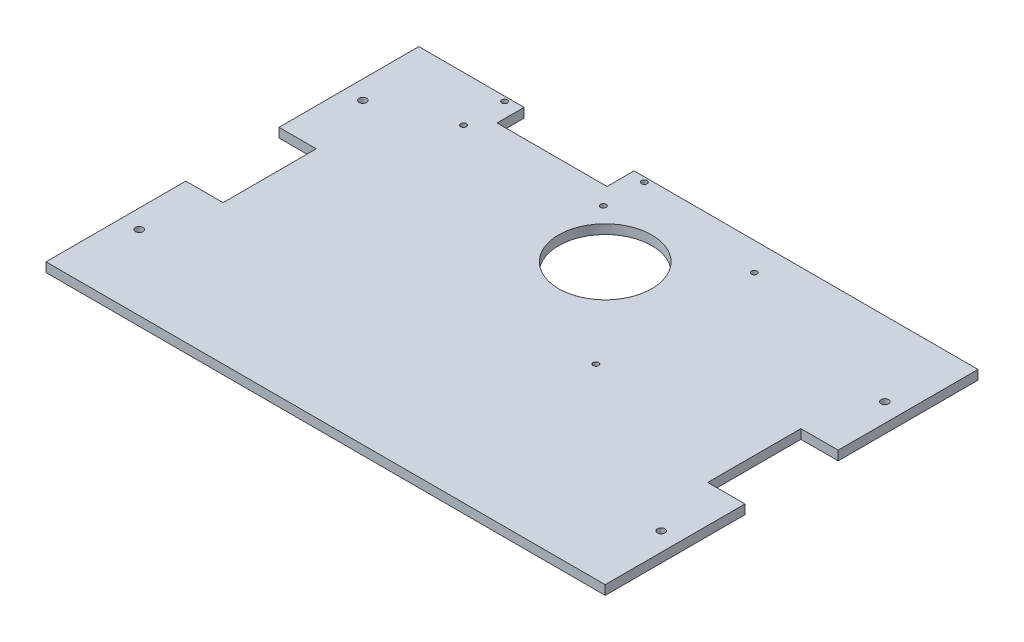
ISO-10303-21;
HEADER;
FILE_DESCRIPTION(('STEP AP214'),'2;1');
FILE_NAME('part.step','',(''),(''),'','','');
FILE_SCHEMA(('AUTOMOTIVE_DESIGN { 1 0 10303 214 1 1 1 1 }'));
ENDSEC;
DATA;
#1=APPLICATION_CONTEXT('core data for automotive mechanical design processes');
#2=APPLICATION_PROTOCOL_DEFINITION('international standard','automotive_design',2000,#1);
#3=PRODUCT_CONTEXT('',#1,'mechanical');
#4=PRODUCT('Part','Part','',(#3));
#5=PRODUCT_RELATED_PRODUCT_CATEGORY('part','',(#4));
#6=PRODUCT_DEFINITION_FORMATION('','',#4);
#7=PRODUCT_DEFINITION_CONTEXT('part definition',#1,'design');
#8=PRODUCT_DEFINITION('design','',#6,#7);
#9=PRODUCT_DEFINITION_SHAPE('','',#8);
#10=(LENGTH_UNIT() NAMED_UNIT(*) SI_UNIT(.MILLI.,.METRE.));
#11=(NAMED_UNIT(*) PLANE_ANGLE_UNIT() SI_UNIT($,.RADIAN.));
#12=(NAMED_UNIT(*) SI_UNIT($,.STERADIAN.) SOLID_ANGLE_UNIT());
#13=UNCERTAINTY_MEASURE_WITH_UNIT(LENGTH_MEASURE(1.E-05),#10,'distance_accuracy_value','');
#14=(GEOMETRIC_REPRESENTATION_CONTEXT(3) GLOBAL_UNCERTAINTY_ASSIGNED_CONTEXT((#13)) GLOBAL_UNIT_ASSIGNED_CONTEXT((#10,
#11,#12)) REPRESENTATION_CONTEXT('',''));
#15=CARTESIAN_POINT('',(0.,0.,0.));
#16=DIRECTION('',(0.,0.,1.));
#17=DIRECTION('',(1.,0.,0.));
#18=AXIS2_PLACEMENT_3D('',#15,#16,#17);
#19=CARTESIAN_POINT('',(150.,5.,-100.));
#20=DIRECTION('',(-1.,0.,0.));
#21=DIRECTION('',(0.,0.,1.));
#22=AXIS2_PLACEMENT_3D('',#19,#20,#21);
#23=PLANE('',#22);
#24=DIRECTION('',(0.,0.,-1.));
#25=VECTOR('',#24,1.);
#26=CARTESIAN_POINT('',(150.,5.,-100.));
#27=LINE('',#26,#25);
#28=CARTESIAN_POINT('',(150.,5.,-25.));
#29=VERTEX_POINT('',#28);
#30=CARTESIAN_POINT('',(150.,5.,-100.));
#31=VERTEX_POINT('',#30);
#32=EDGE_CURVE('E186',#29,#31,#27,.T.);
#33=ORIENTED_EDGE('',*,*,#32,.F.);
#34=DIRECTION('',(0.,1.,0.));
#35=VECTOR('',#34,1.);
#36=CARTESIAN_POINT('',(150.,0.,-25.));
#37=LINE('',#36,#35);
#38=CARTESIAN_POINT('',(150.,0.,-25.));
#39=VERTEX_POINT('',#38);
#40=EDGE_CURVE('E363',#39,#29,#37,.T.);
#41=ORIENTED_EDGE('',*,*,#40,.F.);
#42=DIRECTION('',(0.,0.,-1.));
#43=VECTOR('',#42,1.);
#44=CARTESIAN_POINT('',(150.,0.,-100.));
#45=LINE('',#44,#43);
#46=CARTESIAN_POINT('',(150.,0.,-100.));
#47=VERTEX_POINT('',#46);
#48=EDGE_CURVE('E319',#39,#47,#45,.T.);
#49=ORIENTED_EDGE('',*,*,#48,.T.);
#50=DIRECTION('',(0.,-1.,0.));
#51=VECTOR('',#50,1.);
#52=CARTESIAN_POINT('',(150.,5.,-100.));
#53=LINE('',#52,#51);
#54=EDGE_CURVE('E12',#31,#47,#53,.T.);
#55=ORIENTED_EDGE('',*,*,#54,.F.);
#56=EDGE_LOOP('',(#33,#41,#49,#55));
#57=FACE_BOUND('',#56,.T.);
#58=ADVANCED_FACE('F39',(#57),#23,.F.);
#59=CARTESIAN_POINT('',(-150.,5.,-100.));
#60=DIRECTION('',(1.,0.,0.));
#61=DIRECTION('',(0.,0.,-1.));
#62=AXIS2_PLACEMENT_3D('',#59,#60,#61);
#63=PLANE('',#62);
#64=DIRECTION('',(0.,0.,1.));
#65=VECTOR('',#64,1.);
#66=CARTESIAN_POINT('',(-150.,0.,-100.));
#67=LINE('',#66,#65);
#68=CARTESIAN_POINT('',(-150.,0.,-100.));
#69=VERTEX_POINT('',#68);
#70=CARTESIAN_POINT('',(-150.,0.,-25.));
#71=VERTEX_POINT('',#70);
#72=EDGE_CURVE('E176',#69,#71,#67,.T.);
#73=ORIENTED_EDGE('',*,*,#72,.T.);
#74=DIRECTION('',(0.,1.,0.));
#75=VECTOR('',#74,1.);
#76=CARTESIAN_POINT('',(-150.,0.,-25.));
#77=LINE('',#76,#75);
#78=CARTESIAN_POINT('',(-150.,5.,-25.));
#79=VERTEX_POINT('',#78);
#80=EDGE_CURVE('E254',#71,#79,#77,.T.);
#81=ORIENTED_EDGE('',*,*,#80,.T.);
#82=DIRECTION('',(0.,0.,1.));
#83=VECTOR('',#82,1.);
#84=CARTESIAN_POINT('',(-150.,5.,-100.));
#85=LINE('',#84,#83);
#86=CARTESIAN_POINT('',(-150.,5.,-100.));
#87=VERTEX_POINT('',#86);
#88=EDGE_CURVE('E200',#87,#79,#85,.T.);
#89=ORIENTED_EDGE('',*,*,#88,.F.);
#90=DIRECTION('',(0.,-1.,0.));
#91=VECTOR('',#90,1.);
#92=CARTESIAN_POINT('',(-150.,5.,-100.));
#93=LINE('',#92,#91);
#94=EDGE_CURVE('E47',#87,#69,#93,.T.);
#95=ORIENTED_EDGE('',*,*,#94,.T.);
#96=EDGE_LOOP('',(#73,#81,#89,#95));
#97=FACE_BOUND('',#96,.T.);
#98=ADVANCED_FACE('F197',(#97),#63,.F.);
#99=CARTESIAN_POINT('',(-150.,5.,-100.));
#100=DIRECTION('',(0.,0.,1.));
#101=DIRECTION('',(1.,0.,0.));
#102=AXIS2_PLACEMENT_3D('',#99,#100,#101);
#103=PLANE('',#102);
#104=DIRECTION('',(-1.,0.,0.));
#105=VECTOR('',#104,1.);
#106=CARTESIAN_POINT('',(-150.,5.,-100.));
#107=LINE('',#106,#105);
#108=CARTESIAN_POINT('',(-93.5,5.,-100.));
#109=VERTEX_POINT('',#108);
#110=EDGE_CURVE('E346',#109,#87,#107,.T.);
#111=ORIENTED_EDGE('',*,*,#110,.F.);
#112=DIRECTION('',(0.,-1.,0.));
#113=VECTOR('',#112,1.);
#114=CARTESIAN_POINT('',(-93.5,5.,-100.));
#115=LINE('',#114,#113);
#116=CARTESIAN_POINT('',(-93.5,0.,-100.));
#117=VERTEX_POINT('',#116);
#118=EDGE_CURVE('E270',#109,#117,#115,.T.);
#119=ORIENTED_EDGE('',*,*,#118,.T.);
#120=DIRECTION('',(-1.,0.,0.));
#121=VECTOR('',#120,1.);
#122=CARTESIAN_POINT('',(-150.,0.,-100.));
#123=LINE('',#122,#121);
#124=EDGE_CURVE('E181',#117,#69,#123,.T.);
#125=ORIENTED_EDGE('',*,*,#124,.T.);
#126=ORIENTED_EDGE('',*,*,#94,.F.);
#127=EDGE_LOOP('',(#111,#119,#125,#126));
#128=FACE_BOUND('',#127,.T.);
#129=ADVANCED_FACE('F407',(#128),#103,.F.);
#130=CARTESIAN_POINT('',(150.,0.,100.));
#131=VERTEX_POINT('',#130);
#132=CARTESIAN_POINT('',(150.,0.,25.));
#133=VERTEX_POINT('',#132);
#134=EDGE_CURVE('E385',#131,#133,#45,.T.);
#135=ORIENTED_EDGE('',*,*,#134,.T.);
#136=DIRECTION('',(0.,1.,0.));
#137=VECTOR('',#136,1.);
#138=CARTESIAN_POINT('',(150.,0.,25.));
#139=LINE('',#138,#137);
#140=CARTESIAN_POINT('',(150.,5.,25.));
#141=VERTEX_POINT('',#140);
#142=EDGE_CURVE('E62',#133,#141,#139,.T.);
#143=ORIENTED_EDGE('',*,*,#142,.T.);
#144=CARTESIAN_POINT('',(150.,5.,100.));
#145=VERTEX_POINT('',#144);
#146=EDGE_CURVE('E343',#145,#141,#27,.T.);
#147=ORIENTED_EDGE('',*,*,#146,.F.);
#148=DIRECTION('',(0.,-1.,0.));
#149=VECTOR('',#148,1.);
#150=CARTESIAN_POINT('',(150.,5.,100.));
#151=LINE('',#150,#149);
#152=EDGE_CURVE('E187',#145,#131,#151,.T.);
#153=ORIENTED_EDGE('',*,*,#152,.T.);
#154=EDGE_LOOP('',(#135,#143,#147,#153));
#155=FACE_BOUND('',#154,.T.);
#156=ADVANCED_FACE('F41',(#155),#23,.F.);
#157=CARTESIAN_POINT('',(-34.5,0.,-100.));
#158=VERTEX_POINT('',#157);
#159=EDGE_CURVE('E177',#47,#158,#123,.T.);
#160=ORIENTED_EDGE('',*,*,#159,.T.);
#161=DIRECTION('',(0.,-1.,0.));
#162=VECTOR('',#161,1.);
#163=CARTESIAN_POINT('',(-34.5,5.,-100.));
#164=LINE('',#163,#162);
#165=CARTESIAN_POINT('',(-34.5,5.,-100.));
#166=VERTEX_POINT('',#165);
#167=EDGE_CURVE('E283',#166,#158,#164,.T.);
#168=ORIENTED_EDGE('',*,*,#167,.F.);
#169=EDGE_CURVE('E228',#31,#166,#107,.T.);
#170=ORIENTED_EDGE('',*,*,#169,.F.);
#171=ORIENTED_EDGE('',*,*,#54,.T.);
#172=EDGE_LOOP('',(#160,#168,#170,#171));
#173=FACE_BOUND('',#172,.T.);
#174=ADVANCED_FACE('F403',(#173),#103,.F.);
#175=CARTESIAN_POINT('',(-150.,5.,25.));
#176=VERTEX_POINT('',#175);
#177=CARTESIAN_POINT('',(-150.,5.,100.));
#178=VERTEX_POINT('',#177);
#179=EDGE_CURVE('E169',#176,#178,#85,.T.);
#180=ORIENTED_EDGE('',*,*,#179,.F.);
#181=DIRECTION('',(0.,1.,0.));
#182=VECTOR('',#181,1.);
#183=CARTESIAN_POINT('',(-150.,0.,25.));
#184=LINE('',#183,#182);
#185=CARTESIAN_POINT('',(-150.,0.,25.));
#186=VERTEX_POINT('',#185);
#187=EDGE_CURVE('E156',#186,#176,#184,.T.);
#188=ORIENTED_EDGE('',*,*,#187,.F.);
#189=CARTESIAN_POINT('',(-150.,0.,100.));
#190=VERTEX_POINT('',#189);
#191=EDGE_CURVE('E167',#186,#190,#67,.T.);
#192=ORIENTED_EDGE('',*,*,#191,.T.);
#193=DIRECTION('',(0.,-1.,0.));
#194=VECTOR('',#193,1.);
#195=CARTESIAN_POINT('',(-150.,5.,100.));
#196=LINE('',#195,#194);
#197=EDGE_CURVE('E190',#178,#190,#196,.T.);
#198=ORIENTED_EDGE('',*,*,#197,.F.);
#199=EDGE_LOOP('',(#180,#188,#192,#198));
#200=FACE_BOUND('',#199,.T.);
#201=ADVANCED_FACE('F165',(#200),#63,.F.);
#202=CARTESIAN_POINT('',(-150.,5.,100.));
#203=DIRECTION('',(0.,0.,-1.));
#204=DIRECTION('',(-1.,0.,0.));
#205=AXIS2_PLACEMENT_3D('',#202,#203,#204);
#206=PLANE('',#205);
#207=DIRECTION('',(1.,0.,0.));
#208=VECTOR('',#207,1.);
#209=CARTESIAN_POINT('',(-150.,0.,100.));
#210=LINE('',#209,#208);
#211=EDGE_CURVE('E175',#190,#131,#210,.T.);
#212=ORIENTED_EDGE('',*,*,#211,.T.);
#213=ORIENTED_EDGE('',*,*,#152,.F.);
#214=DIRECTION('',(1.,0.,0.));
#215=VECTOR('',#214,1.);
#216=CARTESIAN_POINT('',(-150.,5.,100.));
#217=LINE('',#216,#215);
#218=EDGE_CURVE('E191',#178,#145,#217,.T.);
#219=ORIENTED_EDGE('',*,*,#218,.F.);
#220=ORIENTED_EDGE('',*,*,#197,.T.);
#221=EDGE_LOOP('',(#212,#213,#219,#220));
#222=FACE_BOUND('',#221,.T.);
#223=ADVANCED_FACE('F392',(#222),#206,.F.);
#224=CARTESIAN_POINT('',(0.,5.,0.));
#225=DIRECTION('',(0.,1.,0.));
#226=DIRECTION('',(0.,0.,1.));
#227=AXIS2_PLACEMENT_3D('',#224,#225,#226);
#228=PLANE('',#227);
#229=DIRECTION('',(-1.,0.,0.));
#230=VECTOR('',#229,1.);
#231=CARTESIAN_POINT('',(-130.,5.,-25.));
#232=LINE('',#231,#230);
#233=CARTESIAN_POINT('',(-130.,5.,-25.));
#234=VERTEX_POINT('',#233);
#235=EDGE_CURVE('E161',#234,#79,#232,.T.);
#236=ORIENTED_EDGE('',*,*,#235,.F.);
#237=DIRECTION('',(0.,0.,-1.));
#238=VECTOR('',#237,1.);
#239=CARTESIAN_POINT('',(-130.,5.,25.));
#240=LINE('',#239,#238);
#241=CARTESIAN_POINT('',(-130.,5.,25.));
#242=VERTEX_POINT('',#241);
#243=EDGE_CURVE('E214',#242,#234,#240,.T.);
#244=ORIENTED_EDGE('',*,*,#243,.F.);
#245=DIRECTION('',(1.,0.,0.));
#246=VECTOR('',#245,1.);
#247=CARTESIAN_POINT('',(-130.,5.,25.));
#248=LINE('',#247,#246);
#249=EDGE_CURVE('E211',#176,#242,#248,.T.);
#250=ORIENTED_EDGE('',*,*,#249,.F.);
#251=ORIENTED_EDGE('',*,*,#179,.T.);
#252=ORIENTED_EDGE('',*,*,#218,.T.);
#253=ORIENTED_EDGE('',*,*,#146,.T.);
#254=DIRECTION('',(1.,0.,0.));
#255=VECTOR('',#254,1.);
#256=CARTESIAN_POINT('',(130.,5.,25.));
#257=LINE('',#256,#255);
#258=CARTESIAN_POINT('',(130.,5.,25.));
#259=VERTEX_POINT('',#258);
#260=EDGE_CURVE('E360',#259,#141,#257,.T.);
#261=ORIENTED_EDGE('',*,*,#260,.F.);
#262=DIRECTION('',(0.,0.,1.));
#263=VECTOR('',#262,1.);
#264=CARTESIAN_POINT('',(130.,5.,25.));
#265=LINE('',#264,#263);
#266=CARTESIAN_POINT('',(130.,5.,-25.));
#267=VERTEX_POINT('',#266);
#268=EDGE_CURVE('E375',#267,#259,#265,.T.);
#269=ORIENTED_EDGE('',*,*,#268,.F.);
#270=DIRECTION('',(-1.,0.,0.));
#271=VECTOR('',#270,1.);
#272=CARTESIAN_POINT('',(130.,5.,-25.));
#273=LINE('',#272,#271);
#274=EDGE_CURVE('E354',#29,#267,#273,.T.);
#275=ORIENTED_EDGE('',*,*,#274,.F.);
#276=ORIENTED_EDGE('',*,*,#32,.T.);
#277=ORIENTED_EDGE('',*,*,#169,.T.);
#278=DIRECTION('',(0.,0.,1.));
#279=VECTOR('',#278,1.);
#280=CARTESIAN_POINT('',(-34.5,5.,-100.));
#281=LINE('',#280,#279);
#282=CARTESIAN_POINT('',(-34.5,5.,-85.5));
#283=VERTEX_POINT('',#282);
#284=EDGE_CURVE('E259',#166,#283,#281,.T.);
#285=ORIENTED_EDGE('',*,*,#284,.T.);
#286=DIRECTION('',(-1.,0.,0.));
#287=VECTOR('',#286,1.);
#288=CARTESIAN_POINT('',(-93.5,5.,-85.5));
#289=LINE('',#288,#287);
#290=CARTESIAN_POINT('',(-93.5,5.,-85.5));
#291=VERTEX_POINT('',#290);
#292=EDGE_CURVE('E266',#283,#291,#289,.T.);
#293=ORIENTED_EDGE('',*,*,#292,.T.);
#294=DIRECTION('',(0.,0.,-1.));
#295=VECTOR('',#294,1.);
#296=CARTESIAN_POINT('',(-93.5,5.,-100.));
#297=LINE('',#296,#295);
#298=EDGE_CURVE('E255',#291,#109,#297,.T.);
#299=ORIENTED_EDGE('',*,*,#298,.T.);
#300=ORIENTED_EDGE('',*,*,#110,.T.);
#301=ORIENTED_EDGE('',*,*,#88,.T.);
#302=EDGE_LOOP('',(#236,#244,#250,#251,#252,#253,#261,#269,#275,#276,#277,#285,#293,#299,#300,#301));
#303=FACE_BOUND('',#302,.T.);
#304=CARTESIAN_POINT('',(45.0000000000001,5.,-85.));
#305=DIRECTION('',(0.,1.,0.));
#306=DIRECTION('',(0.,0.,1.));
#307=AXIS2_PLACEMENT_3D('',#304,#305,#306);
#308=CIRCLE('',#307,1.5);
#309=CARTESIAN_POINT('',(45.0000000000001,5.,-83.5));
#310=VERTEX_POINT('',#309);
#311=EDGE_CURVE('E241',#310,#310,#308,.T.);
#312=ORIENTED_EDGE('',*,*,#311,.F.);
#313=EDGE_LOOP('',(#312));
#314=FACE_BOUND('',#313,.T.);
#315=CARTESIAN_POINT('',(45.0000000000001,5.,0.));
#316=DIRECTION('',(0.,1.,0.));
#317=DIRECTION('',(0.,0.,1.));
#318=AXIS2_PLACEMENT_3D('',#315,#316,#317);
#319=CIRCLE('',#318,1.5);
#320=CARTESIAN_POINT('',(45.0000000000001,5.,1.50000000000004));
#321=VERTEX_POINT('',#320);
#322=EDGE_CURVE('E250',#321,#321,#319,.T.);
#323=ORIENTED_EDGE('',*,*,#322,.F.);
#324=EDGE_LOOP('',(#323));
#325=FACE_BOUND('',#324,.T.);
#326=CARTESIAN_POINT('',(-101.5,5.,-75.4999999999999));
#327=DIRECTION('',(0.,1.,0.));
#328=DIRECTION('',(0.,0.,1.));
#329=AXIS2_PLACEMENT_3D('',#326,#327,#328);
#330=CIRCLE('',#329,1.5);
#331=CARTESIAN_POINT('',(-101.5,5.,-73.9999999999999));
#332=VERTEX_POINT('',#331);
#333=EDGE_CURVE('E280',#332,#332,#330,.T.);
#334=ORIENTED_EDGE('',*,*,#333,.F.);
#335=EDGE_LOOP('',(#334));
#336=FACE_BOUND('',#335,.T.);
#337=CARTESIAN_POINT('',(-26.5,5.,-75.5));
#338=DIRECTION('',(0.,1.,0.));
#339=DIRECTION('',(0.,0.,1.));
#340=AXIS2_PLACEMENT_3D('',#337,#338,#339);
#341=CIRCLE('',#340,1.5);
#342=CARTESIAN_POINT('',(-26.5,5.,-74.));
#343=VERTEX_POINT('',#342);
#344=EDGE_CURVE('E692',#343,#343,#341,.T.);
#345=ORIENTED_EDGE('',*,*,#344,.F.);
#346=EDGE_LOOP('',(#345));
#347=FACE_BOUND('',#346,.T.);
#348=CARTESIAN_POINT('',(-26.5,5.,-97.5));
#349=DIRECTION('',(0.,1.,0.));
#350=DIRECTION('',(0.,0.,1.));
#351=AXIS2_PLACEMENT_3D('',#348,#349,#350);
#352=CIRCLE('',#351,1.5);
#353=CARTESIAN_POINT('',(-26.5,5.,-96.));
#354=VERTEX_POINT('',#353);
#355=EDGE_CURVE('E291',#354,#354,#352,.T.);
#356=ORIENTED_EDGE('',*,*,#355,.F.);
#357=EDGE_LOOP('',(#356));
#358=FACE_BOUND('',#357,.T.);
#359=CARTESIAN_POINT('',(-101.5,5.,-97.4999999999999));
#360=DIRECTION('',(0.,1.,0.));
#361=DIRECTION('',(0.,0.,1.));
#362=AXIS2_PLACEMENT_3D('',#359,#360,#361);
#363=CIRCLE('',#362,1.5);
#364=CARTESIAN_POINT('',(-101.5,5.,-95.9999999999999));
#365=VERTEX_POINT('',#364);
#366=EDGE_CURVE('E290',#365,#365,#363,.T.);
#367=ORIENTED_EDGE('',*,*,#366,.F.);
#368=EDGE_LOOP('',(#367));
#369=FACE_BOUND('',#368,.T.);
#370=CARTESIAN_POINT('',(-140.,5.,-60.));
#371=DIRECTION('',(0.,1.,0.));
#372=DIRECTION('',(0.,0.,1.));
#373=AXIS2_PLACEMENT_3D('',#370,#371,#372);
#374=CIRCLE('',#373,2.);
#375=CARTESIAN_POINT('',(-140.,5.,-58.));
#376=VERTEX_POINT('',#375);
#377=EDGE_CURVE('E320',#376,#376,#374,.T.);
#378=ORIENTED_EDGE('',*,*,#377,.F.);
#379=EDGE_LOOP('',(#378));
#380=FACE_BOUND('',#379,.T.);
#381=CARTESIAN_POINT('',(-140.,5.,59.9999999999999));
#382=DIRECTION('',(0.,1.,0.));
#383=DIRECTION('',(0.,0.,-1.));
#384=AXIS2_PLACEMENT_3D('',#381,#382,#383);
#385=CIRCLE('',#384,2.);
#386=CARTESIAN_POINT('',(-140.,5.,57.9999999999999));
#387=VERTEX_POINT('',#386);
#388=EDGE_CURVE('E327',#387,#387,#385,.T.);
#389=ORIENTED_EDGE('',*,*,#388,.F.);
#390=EDGE_LOOP('',(#389));
#391=FACE_BOUND('',#390,.T.);
#392=CARTESIAN_POINT('',(0.,5.,-50.));
#393=DIRECTION('',(0.,1.,0.));
#394=DIRECTION('',(0.,0.,1.));
#395=AXIS2_PLACEMENT_3D('',#392,#393,#394);
#396=CIRCLE('',#395,25.);
#397=CARTESIAN_POINT('',(0.,5.,-25.));
#398=VERTEX_POINT('',#397);
#399=EDGE_CURVE('E335',#398,#398,#396,.T.);
#400=ORIENTED_EDGE('',*,*,#399,.F.);
#401=EDGE_LOOP('',(#400));
#402=FACE_BOUND('',#401,.T.);
#403=CARTESIAN_POINT('',(140.,5.,60.));
#404=DIRECTION('',(0.,1.,0.));
#405=DIRECTION('',(0.,0.,1.));
#406=AXIS2_PLACEMENT_3D('',#403,#404,#405);
#407=CIRCLE('',#406,2.);
#408=CARTESIAN_POINT('',(140.,5.,62.));
#409=VERTEX_POINT('',#408);
#410=EDGE_CURVE('E312',#409,#409,#407,.T.);
#411=ORIENTED_EDGE('',*,*,#410,.F.);
#412=EDGE_LOOP('',(#411));
#413=FACE_BOUND('',#412,.T.);
#414=CARTESIAN_POINT('',(140.,5.,-59.9999999999999));
#415=DIRECTION('',(0.,1.,0.));
#416=DIRECTION('',(0.,0.,-1.));
#417=AXIS2_PLACEMENT_3D('',#414,#415,#416);
#418=CIRCLE('',#417,2.);
#419=CARTESIAN_POINT('',(140.,5.,-61.9999999999999));
#420=VERTEX_POINT('',#419);
#421=EDGE_CURVE('E313',#420,#420,#418,.T.);
#422=ORIENTED_EDGE('',*,*,#421,.F.);
#423=EDGE_LOOP('',(#422));
#424=FACE_BOUND('',#423,.T.);
#425=ADVANCED_FACE('F387',(#303,#314,#325,#336,#347,#358,#369,#380,#391,#402,#413,#424),#228,.T.);
#426=CARTESIAN_POINT('',(0.,0.,0.));
#427=DIRECTION('',(0.,1.,0.));
#428=DIRECTION('',(0.,0.,1.));
#429=AXIS2_PLACEMENT_3D('',#426,#427,#428);
#430=PLANE('',#429);
#431=CARTESIAN_POINT('',(45.0000000000001,0.,-85.));
#432=DIRECTION('',(0.,1.,0.));
#433=DIRECTION('',(0.,0.,1.));
#434=AXIS2_PLACEMENT_3D('',#431,#432,#433);
#435=CIRCLE('',#434,1.5);
#436=CARTESIAN_POINT('',(45.0000000000001,0.,-83.5));
#437=VERTEX_POINT('',#436);
#438=EDGE_CURVE('E246',#437,#437,#435,.T.);
#439=ORIENTED_EDGE('',*,*,#438,.T.);
#440=EDGE_LOOP('',(#439));
#441=FACE_BOUND('',#440,.T.);
#442=CARTESIAN_POINT('',(45.0000000000001,0.,0.));
#443=DIRECTION('',(0.,1.,0.));
#444=DIRECTION('',(0.,0.,1.));
#445=AXIS2_PLACEMENT_3D('',#442,#443,#444);
#446=CIRCLE('',#445,1.5);
#447=CARTESIAN_POINT('',(45.0000000000001,0.,1.50000000000004));
#448=VERTEX_POINT('',#447);
#449=EDGE_CURVE('E247',#448,#448,#446,.T.);
#450=ORIENTED_EDGE('',*,*,#449,.T.);
#451=EDGE_LOOP('',(#450));
#452=FACE_BOUND('',#451,.T.);
#453=CARTESIAN_POINT('',(-101.5,0.,-75.4999999999999));
#454=DIRECTION('',(0.,1.,0.));
#455=DIRECTION('',(0.,0.,1.));
#456=AXIS2_PLACEMENT_3D('',#453,#454,#455);
#457=CIRCLE('',#456,1.5);
#458=CARTESIAN_POINT('',(-101.5,0.,-73.9999999999999));
#459=VERTEX_POINT('',#458);
#460=EDGE_CURVE('E714',#459,#459,#457,.T.);
#461=ORIENTED_EDGE('',*,*,#460,.T.);
#462=EDGE_LOOP('',(#461));
#463=FACE_BOUND('',#462,.T.);
#464=CARTESIAN_POINT('',(-26.5,0.,-75.5));
#465=DIRECTION('',(0.,1.,0.));
#466=DIRECTION('',(0.,0.,1.));
#467=AXIS2_PLACEMENT_3D('',#464,#465,#466);
#468=CIRCLE('',#467,1.5);
#469=CARTESIAN_POINT('',(-26.5,0.,-74.));
#470=VERTEX_POINT('',#469);
#471=EDGE_CURVE('E295',#470,#470,#468,.T.);
#472=ORIENTED_EDGE('',*,*,#471,.T.);
#473=EDGE_LOOP('',(#472));
#474=FACE_BOUND('',#473,.T.);
#475=CARTESIAN_POINT('',(-26.5,0.,-97.5));
#476=DIRECTION('',(0.,1.,0.));
#477=DIRECTION('',(0.,0.,1.));
#478=AXIS2_PLACEMENT_3D('',#475,#476,#477);
#479=CIRCLE('',#478,1.5);
#480=CARTESIAN_POINT('',(-26.5,0.,-96.));
#481=VERTEX_POINT('',#480);
#482=EDGE_CURVE('E287',#481,#481,#479,.T.);
#483=ORIENTED_EDGE('',*,*,#482,.T.);
#484=EDGE_LOOP('',(#483));
#485=FACE_BOUND('',#484,.T.);
#486=CARTESIAN_POINT('',(-101.5,0.,-97.4999999999999));
#487=DIRECTION('',(0.,1.,0.));
#488=DIRECTION('',(0.,0.,1.));
#489=AXIS2_PLACEMENT_3D('',#486,#487,#488);
#490=CIRCLE('',#489,1.5);
#491=CARTESIAN_POINT('',(-101.5,0.,-95.9999999999999));
#492=VERTEX_POINT('',#491);
#493=EDGE_CURVE('E308',#492,#492,#490,.T.);
#494=ORIENTED_EDGE('',*,*,#493,.T.);
#495=EDGE_LOOP('',(#494));
#496=FACE_BOUND('',#495,.T.);
#497=CARTESIAN_POINT('',(-140.,0.,-60.));
#498=DIRECTION('',(0.,1.,0.));
#499=DIRECTION('',(0.,0.,1.));
#500=AXIS2_PLACEMENT_3D('',#497,#498,#499);
#501=CIRCLE('',#500,2.);
#502=CARTESIAN_POINT('',(-140.,0.,-58.));
#503=VERTEX_POINT('',#502);
#504=EDGE_CURVE('E317',#503,#503,#501,.T.);
#505=ORIENTED_EDGE('',*,*,#504,.T.);
#506=EDGE_LOOP('',(#505));
#507=FACE_BOUND('',#506,.T.);
#508=CARTESIAN_POINT('',(-140.,0.,59.9999999999999));
#509=DIRECTION('',(0.,1.,0.));
#510=DIRECTION('',(0.,0.,-1.));
#511=AXIS2_PLACEMENT_3D('',#508,#509,#510);
#512=CIRCLE('',#511,2.);
#513=CARTESIAN_POINT('',(-140.,0.,57.9999999999999));
#514=VERTEX_POINT('',#513);
#515=EDGE_CURVE('E324',#514,#514,#512,.T.);
#516=ORIENTED_EDGE('',*,*,#515,.T.);
#517=EDGE_LOOP('',(#516));
#518=FACE_BOUND('',#517,.T.);
#519=CARTESIAN_POINT('',(0.,0.,-50.));
#520=DIRECTION('',(0.,1.,0.));
#521=DIRECTION('',(0.,0.,1.));
#522=AXIS2_PLACEMENT_3D('',#519,#520,#521);
#523=CIRCLE('',#522,25.);
#524=CARTESIAN_POINT('',(0.,0.,-25.));
#525=VERTEX_POINT('',#524);
#526=EDGE_CURVE('E331',#525,#525,#523,.T.);
#527=ORIENTED_EDGE('',*,*,#526,.T.);
#528=EDGE_LOOP('',(#527));
#529=FACE_BOUND('',#528,.T.);
#530=CARTESIAN_POINT('',(140.,0.,60.));
#531=DIRECTION('',(0.,1.,0.));
#532=DIRECTION('',(0.,0.,1.));
#533=AXIS2_PLACEMENT_3D('',#530,#531,#532);
#534=CIRCLE('',#533,2.);
#535=CARTESIAN_POINT('',(140.,0.,62.));
#536=VERTEX_POINT('',#535);
#537=EDGE_CURVE('E339',#536,#536,#534,.T.);
#538=ORIENTED_EDGE('',*,*,#537,.T.);
#539=EDGE_LOOP('',(#538));
#540=FACE_BOUND('',#539,.T.);
#541=CARTESIAN_POINT('',(140.,0.,-59.9999999999999));
#542=DIRECTION('',(0.,1.,0.));
#543=DIRECTION('',(0.,0.,-1.));
#544=AXIS2_PLACEMENT_3D('',#541,#542,#543);
#545=CIRCLE('',#544,2.);
#546=CARTESIAN_POINT('',(140.,0.,-61.9999999999999));
#547=VERTEX_POINT('',#546);
#548=EDGE_CURVE('E310',#547,#547,#545,.T.);
#549=ORIENTED_EDGE('',*,*,#548,.T.);
#550=EDGE_LOOP('',(#549));
#551=FACE_BOUND('',#550,.T.);
#552=DIRECTION('',(0.,0.,-1.));
#553=VECTOR('',#552,1.);
#554=CARTESIAN_POINT('',(-130.,0.,25.));
#555=LINE('',#554,#553);
#556=CARTESIAN_POINT('',(-130.,0.,25.));
#557=VERTEX_POINT('',#556);
#558=CARTESIAN_POINT('',(-130.,0.,-25.));
#559=VERTEX_POINT('',#558);
#560=EDGE_CURVE('E54',#557,#559,#555,.T.);
#561=ORIENTED_EDGE('',*,*,#560,.T.);
#562=DIRECTION('',(-1.,0.,0.));
#563=VECTOR('',#562,1.);
#564=CARTESIAN_POINT('',(-130.,0.,-25.));
#565=LINE('',#564,#563);
#566=EDGE_CURVE('E170',#559,#71,#565,.T.);
#567=ORIENTED_EDGE('',*,*,#566,.T.);
#568=ORIENTED_EDGE('',*,*,#72,.F.);
#569=ORIENTED_EDGE('',*,*,#124,.F.);
#570=DIRECTION('',(0.,0.,-1.));
#571=VECTOR('',#570,1.);
#572=CARTESIAN_POINT('',(-93.5,0.,-100.));
#573=LINE('',#572,#571);
#574=CARTESIAN_POINT('',(-93.5,0.,-85.5));
#575=VERTEX_POINT('',#574);
#576=EDGE_CURVE('E271',#575,#117,#573,.T.);
#577=ORIENTED_EDGE('',*,*,#576,.F.);
#578=DIRECTION('',(-1.,0.,0.));
#579=VECTOR('',#578,1.);
#580=CARTESIAN_POINT('',(-93.5,0.,-85.5));
#581=LINE('',#580,#579);
#582=CARTESIAN_POINT('',(-34.5,0.,-85.5));
#583=VERTEX_POINT('',#582);
#584=EDGE_CURVE('E260',#583,#575,#581,.T.);
#585=ORIENTED_EDGE('',*,*,#584,.F.);
#586=DIRECTION('',(0.,0.,1.));
#587=VECTOR('',#586,1.);
#588=CARTESIAN_POINT('',(-34.5,0.,-100.));
#589=LINE('',#588,#587);
#590=EDGE_CURVE('E273',#158,#583,#589,.T.);
#591=ORIENTED_EDGE('',*,*,#590,.F.);
#592=ORIENTED_EDGE('',*,*,#159,.F.);
#593=ORIENTED_EDGE('',*,*,#48,.F.);
#594=DIRECTION('',(-1.,0.,0.));
#595=VECTOR('',#594,1.);
#596=CARTESIAN_POINT('',(130.,0.,-25.));
#597=LINE('',#596,#595);
#598=CARTESIAN_POINT('',(130.,0.,-25.));
#599=VERTEX_POINT('',#598);
#600=EDGE_CURVE('E366',#39,#599,#597,.T.);
#601=ORIENTED_EDGE('',*,*,#600,.T.);
#602=DIRECTION('',(0.,0.,1.));
#603=VECTOR('',#602,1.);
#604=CARTESIAN_POINT('',(130.,0.,25.));
#605=LINE('',#604,#603);
#606=CARTESIAN_POINT('',(130.,0.,25.));
#607=VERTEX_POINT('',#606);
#608=EDGE_CURVE('E359',#599,#607,#605,.T.);
#609=ORIENTED_EDGE('',*,*,#608,.T.);
#610=DIRECTION('',(1.,0.,0.));
#611=VECTOR('',#610,1.);
#612=CARTESIAN_POINT('',(130.,0.,25.));
#613=LINE('',#612,#611);
#614=EDGE_CURVE('E369',#607,#133,#613,.T.);
#615=ORIENTED_EDGE('',*,*,#614,.T.);
#616=ORIENTED_EDGE('',*,*,#134,.F.);
#617=ORIENTED_EDGE('',*,*,#211,.F.);
#618=ORIENTED_EDGE('',*,*,#191,.F.);
#619=DIRECTION('',(1.,0.,0.));
#620=VECTOR('',#619,1.);
#621=CARTESIAN_POINT('',(-130.,0.,25.));
#622=LINE('',#621,#620);
#623=EDGE_CURVE('E152',#186,#557,#622,.T.);
#624=ORIENTED_EDGE('',*,*,#623,.T.);
#625=EDGE_LOOP('',(#561,#567,#568,#569,#577,#585,#591,#592,#593,#601,#609,#615,#616,#617,#618,#624));
#626=FACE_BOUND('',#625,.T.);
#627=ADVANCED_FACE('F173',(#441,#452,#463,#474,#485,#496,#507,#518,#529,#540,#551,#626),#430,.F.);
#628=CARTESIAN_POINT('',(140.,0.,-59.9999999999999));
#629=DIRECTION('',(0.,1.,0.));
#630=DIRECTION('',(0.,0.,1.));
#631=AXIS2_PLACEMENT_3D('',#628,#629,#630);
#632=CYLINDRICAL_SURFACE('',#631,2.);
#633=ORIENTED_EDGE('',*,*,#548,.F.);
#634=EDGE_LOOP('',(#633));
#635=FACE_BOUND('',#634,.T.);
#636=ORIENTED_EDGE('',*,*,#421,.T.);
#637=EDGE_LOOP('',(#636));
#638=FACE_BOUND('',#637,.T.);
#639=ADVANCED_FACE('F445',(#635,#638),#632,.F.);
#640=CARTESIAN_POINT('',(140.,0.,60.));
#641=DIRECTION('',(0.,1.,0.));
#642=DIRECTION('',(0.,0.,1.));
#643=AXIS2_PLACEMENT_3D('',#640,#641,#642);
#644=CYLINDRICAL_SURFACE('',#643,2.);
#645=ORIENTED_EDGE('',*,*,#537,.F.);
#646=EDGE_LOOP('',(#645));
#647=FACE_BOUND('',#646,.T.);
#648=ORIENTED_EDGE('',*,*,#410,.T.);
#649=EDGE_LOOP('',(#648));
#650=FACE_BOUND('',#649,.T.);
#651=ADVANCED_FACE('F449',(#647,#650),#644,.F.);
#652=CARTESIAN_POINT('',(0.,0.,-50.));
#653=DIRECTION('',(0.,1.,0.));
#654=DIRECTION('',(0.,0.,1.));
#655=AXIS2_PLACEMENT_3D('',#652,#653,#654);
#656=CYLINDRICAL_SURFACE('',#655,25.);
#657=ORIENTED_EDGE('',*,*,#526,.F.);
#658=EDGE_LOOP('',(#657));
#659=FACE_BOUND('',#658,.T.);
#660=ORIENTED_EDGE('',*,*,#399,.T.);
#661=EDGE_LOOP('',(#660));
#662=FACE_BOUND('',#661,.T.);
#663=ADVANCED_FACE('F452',(#659,#662),#656,.F.);
#664=CARTESIAN_POINT('',(-140.,0.,59.9999999999999));
#665=DIRECTION('',(0.,1.,0.));
#666=DIRECTION('',(0.,0.,1.));
#667=AXIS2_PLACEMENT_3D('',#664,#665,#666);
#668=CYLINDRICAL_SURFACE('',#667,2.);
#669=ORIENTED_EDGE('',*,*,#515,.F.);
#670=EDGE_LOOP('',(#669));
#671=FACE_BOUND('',#670,.T.);
#672=ORIENTED_EDGE('',*,*,#388,.T.);
#673=EDGE_LOOP('',(#672));
#674=FACE_BOUND('',#673,.T.);
#675=ADVANCED_FACE('F456',(#671,#674),#668,.F.);
#676=CARTESIAN_POINT('',(-140.,0.,-60.));
#677=DIRECTION('',(0.,1.,0.));
#678=DIRECTION('',(0.,0.,1.));
#679=AXIS2_PLACEMENT_3D('',#676,#677,#678);
#680=CYLINDRICAL_SURFACE('',#679,2.);
#681=ORIENTED_EDGE('',*,*,#504,.F.);
#682=EDGE_LOOP('',(#681));
#683=FACE_BOUND('',#682,.T.);
#684=ORIENTED_EDGE('',*,*,#377,.T.);
#685=EDGE_LOOP('',(#684));
#686=FACE_BOUND('',#685,.T.);
#687=ADVANCED_FACE('F460',(#683,#686),#680,.F.);
#688=CARTESIAN_POINT('',(-101.5,0.,-97.4999999999999));
#689=DIRECTION('',(0.,1.,0.));
#690=DIRECTION('',(0.,0.,1.));
#691=AXIS2_PLACEMENT_3D('',#688,#689,#690);
#692=CYLINDRICAL_SURFACE('',#691,1.5);
#693=ORIENTED_EDGE('',*,*,#493,.F.);
#694=EDGE_LOOP('',(#693));
#695=FACE_BOUND('',#694,.T.);
#696=ORIENTED_EDGE('',*,*,#366,.T.);
#697=EDGE_LOOP('',(#696));
#698=FACE_BOUND('',#697,.T.);
#699=ADVANCED_FACE('F464',(#695,#698),#692,.F.);
#700=CARTESIAN_POINT('',(-26.5,0.,-97.5));
#701=DIRECTION('',(0.,1.,0.));
#702=DIRECTION('',(0.,0.,1.));
#703=AXIS2_PLACEMENT_3D('',#700,#701,#702);
#704=CYLINDRICAL_SURFACE('',#703,1.5);
#705=ORIENTED_EDGE('',*,*,#482,.F.);
#706=EDGE_LOOP('',(#705));
#707=FACE_BOUND('',#706,.T.);
#708=ORIENTED_EDGE('',*,*,#355,.T.);
#709=EDGE_LOOP('',(#708));
#710=FACE_BOUND('',#709,.T.);
#711=ADVANCED_FACE('F471',(#707,#710),#704,.F.);
#712=CARTESIAN_POINT('',(-26.5,0.,-75.5));
#713=DIRECTION('',(0.,1.,0.));
#714=DIRECTION('',(0.,0.,1.));
#715=AXIS2_PLACEMENT_3D('',#712,#713,#714);
#716=CYLINDRICAL_SURFACE('',#715,1.5);
#717=ORIENTED_EDGE('',*,*,#471,.F.);
#718=EDGE_LOOP('',(#717));
#719=FACE_BOUND('',#718,.T.);
#720=ORIENTED_EDGE('',*,*,#344,.T.);
#721=EDGE_LOOP('',(#720));
#722=FACE_BOUND('',#721,.T.);
#723=ADVANCED_FACE('F476',(#719,#722),#716,.F.);
#724=CARTESIAN_POINT('',(-101.5,0.,-75.4999999999999));
#725=DIRECTION('',(0.,1.,0.));
#726=DIRECTION('',(0.,0.,1.));
#727=AXIS2_PLACEMENT_3D('',#724,#725,#726);
#728=CYLINDRICAL_SURFACE('',#727,1.5);
#729=ORIENTED_EDGE('',*,*,#460,.F.);
#730=EDGE_LOOP('',(#729));
#731=FACE_BOUND('',#730,.T.);
#732=ORIENTED_EDGE('',*,*,#333,.T.);
#733=EDGE_LOOP('',(#732));
#734=FACE_BOUND('',#733,.T.);
#735=ADVANCED_FACE('F473',(#731,#734),#728,.F.);
#736=CARTESIAN_POINT('',(-93.5,5.,-100.));
#737=DIRECTION('',(-1.,0.,0.));
#738=DIRECTION('',(0.,0.,1.));
#739=AXIS2_PLACEMENT_3D('',#736,#737,#738);
#740=PLANE('',#739);
#741=ORIENTED_EDGE('',*,*,#576,.T.);
#742=ORIENTED_EDGE('',*,*,#118,.F.);
#743=ORIENTED_EDGE('',*,*,#298,.F.);
#744=DIRECTION('',(0.,-1.,0.));
#745=VECTOR('',#744,1.);
#746=CARTESIAN_POINT('',(-93.5,5.,-85.5));
#747=LINE('',#746,#745);
#748=EDGE_CURVE('E278',#291,#575,#747,.T.);
#749=ORIENTED_EDGE('',*,*,#748,.T.);
#750=EDGE_LOOP('',(#741,#742,#743,#749));
#751=FACE_BOUND('',#750,.T.);
#752=ADVANCED_FACE('F409',(#751),#740,.F.);
#753=CARTESIAN_POINT('',(-93.5,5.,-85.5));
#754=DIRECTION('',(0.,0.,1.));
#755=DIRECTION('',(1.,0.,0.));
#756=AXIS2_PLACEMENT_3D('',#753,#754,#755);
#757=PLANE('',#756);
#758=ORIENTED_EDGE('',*,*,#584,.T.);
#759=ORIENTED_EDGE('',*,*,#748,.F.);
#760=ORIENTED_EDGE('',*,*,#292,.F.);
#761=DIRECTION('',(0.,-1.,0.));
#762=VECTOR('',#761,1.);
#763=CARTESIAN_POINT('',(-34.5,5.,-85.5));
#764=LINE('',#763,#762);
#765=EDGE_CURVE('E281',#283,#583,#764,.T.);
#766=ORIENTED_EDGE('',*,*,#765,.T.);
#767=EDGE_LOOP('',(#758,#759,#760,#766));
#768=FACE_BOUND('',#767,.T.);
#769=ADVANCED_FACE('F411',(#768),#757,.F.);
#770=CARTESIAN_POINT('',(-34.5,5.,-100.));
#771=DIRECTION('',(1.,0.,0.));
#772=DIRECTION('',(0.,0.,-1.));
#773=AXIS2_PLACEMENT_3D('',#770,#771,#772);
#774=PLANE('',#773);
#775=ORIENTED_EDGE('',*,*,#590,.T.);
#776=ORIENTED_EDGE('',*,*,#765,.F.);
#777=ORIENTED_EDGE('',*,*,#284,.F.);
#778=ORIENTED_EDGE('',*,*,#167,.T.);
#779=EDGE_LOOP('',(#775,#776,#777,#778));
#780=FACE_BOUND('',#779,.T.);
#781=ADVANCED_FACE('F414',(#780),#774,.F.);
#782=CARTESIAN_POINT('',(45.0000000000001,0.,0.));
#783=DIRECTION('',(0.,1.,0.));
#784=DIRECTION('',(0.,0.,1.));
#785=AXIS2_PLACEMENT_3D('',#782,#783,#784);
#786=CYLINDRICAL_SURFACE('',#785,1.5);
#787=ORIENTED_EDGE('',*,*,#449,.F.);
#788=EDGE_LOOP('',(#787));
#789=FACE_BOUND('',#788,.T.);
#790=ORIENTED_EDGE('',*,*,#322,.T.);
#791=EDGE_LOOP('',(#790));
#792=FACE_BOUND('',#791,.T.);
#793=ADVANCED_FACE('F416',(#789,#792),#786,.F.);
#794=CARTESIAN_POINT('',(45.0000000000001,0.,-85.));
#795=DIRECTION('',(0.,1.,0.));
#796=DIRECTION('',(0.,0.,1.));
#797=AXIS2_PLACEMENT_3D('',#794,#795,#796);
#798=CYLINDRICAL_SURFACE('',#797,1.5);
#799=ORIENTED_EDGE('',*,*,#438,.F.);
#800=EDGE_LOOP('',(#799));
#801=FACE_BOUND('',#800,.T.);
#802=ORIENTED_EDGE('',*,*,#311,.T.);
#803=EDGE_LOOP('',(#802));
#804=FACE_BOUND('',#803,.T.);
#805=ADVANCED_FACE('F422',(#801,#804),#798,.F.);
#806=CARTESIAN_POINT('',(130.,0.,25.));
#807=DIRECTION('',(-1.,0.,0.));
#808=DIRECTION('',(0.,0.,1.));
#809=AXIS2_PLACEMENT_3D('',#806,#807,#808);
#810=PLANE('',#809);
#811=ORIENTED_EDGE('',*,*,#268,.T.);
#812=DIRECTION('',(0.,1.,0.));
#813=VECTOR('',#812,1.);
#814=CARTESIAN_POINT('',(130.,0.,25.));
#815=LINE('',#814,#813);
#816=EDGE_CURVE('E365',#607,#259,#815,.T.);
#817=ORIENTED_EDGE('',*,*,#816,.F.);
#818=ORIENTED_EDGE('',*,*,#608,.F.);
#819=DIRECTION('',(0.,1.,0.));
#820=VECTOR('',#819,1.);
#821=CARTESIAN_POINT('',(130.,0.,-25.));
#822=LINE('',#821,#820);
#823=EDGE_CURVE('E215',#599,#267,#822,.T.);
#824=ORIENTED_EDGE('',*,*,#823,.T.);
#825=EDGE_LOOP('',(#811,#817,#818,#824));
#826=FACE_BOUND('',#825,.T.);
#827=ADVANCED_FACE('F511',(#826),#810,.F.);
#828=CARTESIAN_POINT('',(130.,0.,-25.));
#829=DIRECTION('',(0.,0.,-1.));
#830=DIRECTION('',(-1.,0.,0.));
#831=AXIS2_PLACEMENT_3D('',#828,#829,#830);
#832=PLANE('',#831);
#833=ORIENTED_EDGE('',*,*,#274,.T.);
#834=ORIENTED_EDGE('',*,*,#823,.F.);
#835=ORIENTED_EDGE('',*,*,#600,.F.);
#836=ORIENTED_EDGE('',*,*,#40,.T.);
#837=EDGE_LOOP('',(#833,#834,#835,#836));
#838=FACE_BOUND('',#837,.T.);
#839=ADVANCED_FACE('F557',(#838),#832,.F.);
#840=CARTESIAN_POINT('',(130.,0.,25.));
#841=DIRECTION('',(0.,0.,1.));
#842=DIRECTION('',(1.,0.,0.));
#843=AXIS2_PLACEMENT_3D('',#840,#841,#842);
#844=PLANE('',#843);
#845=ORIENTED_EDGE('',*,*,#260,.T.);
#846=ORIENTED_EDGE('',*,*,#142,.F.);
#847=ORIENTED_EDGE('',*,*,#614,.F.);
#848=ORIENTED_EDGE('',*,*,#816,.T.);
#849=EDGE_LOOP('',(#845,#846,#847,#848));
#850=FACE_BOUND('',#849,.T.);
#851=ADVANCED_FACE('F380',(#850),#844,.F.);
#852=CARTESIAN_POINT('',(-130.,0.,-25.));
#853=DIRECTION('',(0.,0.,-1.));
#854=DIRECTION('',(-1.,0.,0.));
#855=AXIS2_PLACEMENT_3D('',#852,#853,#854);
#856=PLANE('',#855);
#857=ORIENTED_EDGE('',*,*,#235,.T.);
#858=ORIENTED_EDGE('',*,*,#80,.F.);
#859=ORIENTED_EDGE('',*,*,#566,.F.);
#860=DIRECTION('',(0.,1.,0.));
#861=VECTOR('',#860,1.);
#862=CARTESIAN_POINT('',(-130.,0.,-25.));
#863=LINE('',#862,#861);
#864=EDGE_CURVE('E606',#559,#234,#863,.T.);
#865=ORIENTED_EDGE('',*,*,#864,.T.);
#866=EDGE_LOOP('',(#857,#858,#859,#865));
#867=FACE_BOUND('',#866,.T.);
#868=ADVANCED_FACE('F575',(#867),#856,.F.);
#869=CARTESIAN_POINT('',(-130.,0.,25.));
#870=DIRECTION('',(1.,0.,0.));
#871=DIRECTION('',(0.,0.,-1.));
#872=AXIS2_PLACEMENT_3D('',#869,#870,#871);
#873=PLANE('',#872);
#874=ORIENTED_EDGE('',*,*,#243,.T.);
#875=ORIENTED_EDGE('',*,*,#864,.F.);
#876=ORIENTED_EDGE('',*,*,#560,.F.);
#877=DIRECTION('',(0.,1.,0.));
#878=VECTOR('',#877,1.);
#879=CARTESIAN_POINT('',(-130.,0.,25.));
#880=LINE('',#879,#878);
#881=EDGE_CURVE('E158',#557,#242,#880,.T.);
#882=ORIENTED_EDGE('',*,*,#881,.T.);
#883=EDGE_LOOP('',(#874,#875,#876,#882));
#884=FACE_BOUND('',#883,.T.);
#885=ADVANCED_FACE('F584',(#884),#873,.F.);
#886=CARTESIAN_POINT('',(-130.,0.,25.));
#887=DIRECTION('',(0.,0.,1.));
#888=DIRECTION('',(1.,0.,0.));
#889=AXIS2_PLACEMENT_3D('',#886,#887,#888);
#890=PLANE('',#889);
#891=ORIENTED_EDGE('',*,*,#249,.T.);
#892=ORIENTED_EDGE('',*,*,#881,.F.);
#893=ORIENTED_EDGE('',*,*,#623,.F.);
#894=ORIENTED_EDGE('',*,*,#187,.T.);
#895=EDGE_LOOP('',(#891,#892,#893,#894));
#896=FACE_BOUND('',#895,.T.);
#897=ADVANCED_FACE('F155',(#896),#890,.F.);
#898=CLOSED_SHELL('',(#58,#98,#129,#156,#174,#201,#223,#425,#627,#639,#651,#663,#675,#687,#699,
#711,#723,#735,#752,#769,#781,#793,#805,#827,#839,#851,#868,#885,#897));
#899=MANIFOLD_SOLID_BREP('B2',#898);
#900=ADVANCED_BREP_SHAPE_REPRESENTATION('',(#18,#899),#14);
#901=SHAPE_DEFINITION_REPRESENTATION(#9,#900);
ENDSEC;
END-ISO-10303-21;
